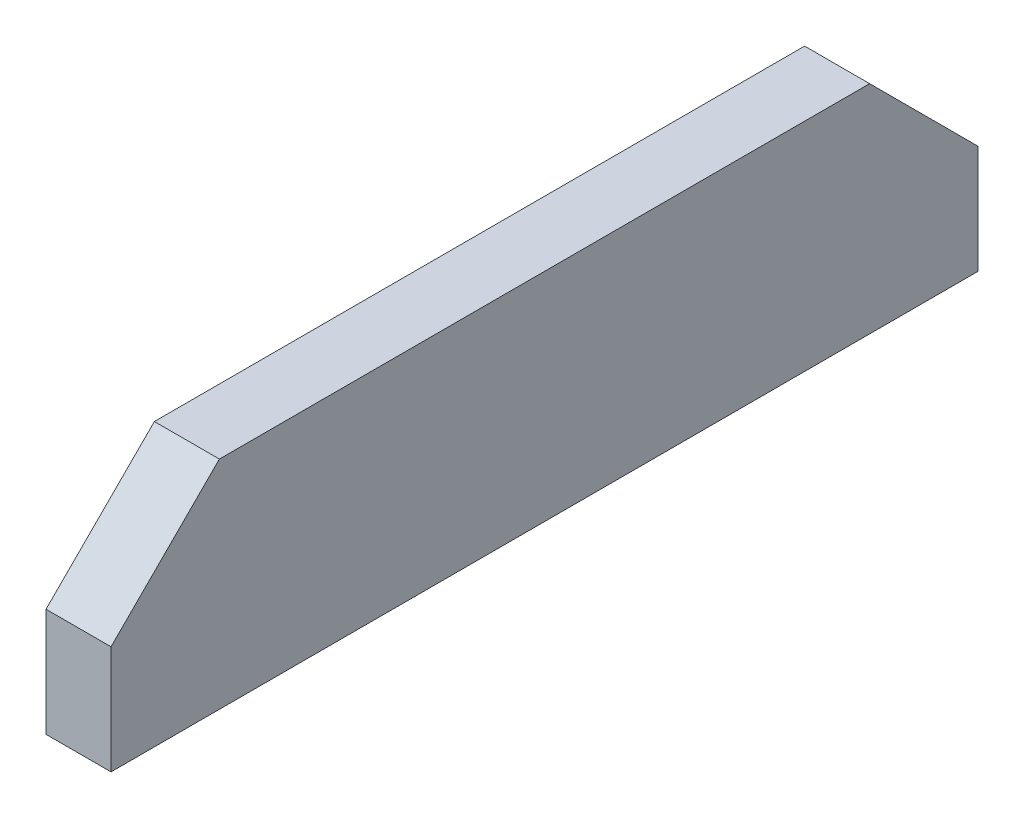
ISO-10303-21;
HEADER;
FILE_DESCRIPTION(('STEP AP214'),'2;1');
FILE_NAME('part.step','',(''),(''),'','','');
FILE_SCHEMA(('AUTOMOTIVE_DESIGN { 1 0 10303 214 1 1 1 1 }'));
ENDSEC;
DATA;
#1=APPLICATION_CONTEXT('core data for automotive mechanical design processes');
#2=APPLICATION_PROTOCOL_DEFINITION('international standard','automotive_design',2000,#1);
#3=PRODUCT_CONTEXT('',#1,'mechanical');
#4=PRODUCT('Part','Part','',(#3));
#5=PRODUCT_RELATED_PRODUCT_CATEGORY('part','',(#4));
#6=PRODUCT_DEFINITION_FORMATION('','',#4);
#7=PRODUCT_DEFINITION_CONTEXT('part definition',#1,'design');
#8=PRODUCT_DEFINITION('design','',#6,#7);
#9=PRODUCT_DEFINITION_SHAPE('','',#8);
#10=(LENGTH_UNIT() NAMED_UNIT(*) SI_UNIT(.MILLI.,.METRE.));
#11=(NAMED_UNIT(*) PLANE_ANGLE_UNIT() SI_UNIT($,.RADIAN.));
#12=(NAMED_UNIT(*) SI_UNIT($,.STERADIAN.) SOLID_ANGLE_UNIT());
#13=UNCERTAINTY_MEASURE_WITH_UNIT(LENGTH_MEASURE(1.E-05),#10,'distance_accuracy_value','');
#14=(GEOMETRIC_REPRESENTATION_CONTEXT(3) GLOBAL_UNCERTAINTY_ASSIGNED_CONTEXT((#13)) GLOBAL_UNIT_ASSIGNED_CONTEXT((#10,
#11,#12)) REPRESENTATION_CONTEXT('',''));
#15=CARTESIAN_POINT('',(0.,0.,0.));
#16=DIRECTION('',(0.,0.,1.));
#17=DIRECTION('',(1.,0.,0.));
#18=AXIS2_PLACEMENT_3D('',#15,#16,#17);
#19=CARTESIAN_POINT('',(3.,5.,0.));
#20=DIRECTION('',(0.,0.,-1.));
#21=DIRECTION('',(-1.,0.,0.));
#22=AXIS2_PLACEMENT_3D('',#19,#20,#21);
#23=PLANE('',#22);
#24=DIRECTION('',(0.,-1.,0.));
#25=VECTOR('',#24,1.);
#26=CARTESIAN_POINT('',(0.,5.,0.));
#27=LINE('',#26,#25);
#28=CARTESIAN_POINT('',(0.,5.,0.));
#29=VERTEX_POINT('',#28);
#30=CARTESIAN_POINT('',(0.,0.,0.));
#31=VERTEX_POINT('',#30);
#32=EDGE_CURVE('E118',#29,#31,#27,.T.);
#33=ORIENTED_EDGE('',*,*,#32,.T.);
#34=DIRECTION('',(-1.,0.,0.));
#35=VECTOR('',#34,1.);
#36=CARTESIAN_POINT('',(3.,0.,0.));
#37=LINE('',#36,#35);
#38=CARTESIAN_POINT('',(3.,0.,0.));
#39=VERTEX_POINT('',#38);
#40=EDGE_CURVE('E11',#39,#31,#37,.T.);
#41=ORIENTED_EDGE('',*,*,#40,.F.);
#42=DIRECTION('',(0.,-1.,0.));
#43=VECTOR('',#42,1.);
#44=CARTESIAN_POINT('',(3.,5.,0.));
#45=LINE('',#44,#43);
#46=CARTESIAN_POINT('',(3.,5.,0.));
#47=VERTEX_POINT('',#46);
#48=EDGE_CURVE('E128',#47,#39,#45,.T.);
#49=ORIENTED_EDGE('',*,*,#48,.F.);
#50=DIRECTION('',(-1.,0.,0.));
#51=VECTOR('',#50,1.);
#52=CARTESIAN_POINT('',(3.,5.,0.));
#53=LINE('',#52,#51);
#54=EDGE_CURVE('E114',#47,#29,#53,.T.);
#55=ORIENTED_EDGE('',*,*,#54,.T.);
#56=EDGE_LOOP('',(#33,#41,#49,#55));
#57=FACE_BOUND('',#56,.T.);
#58=ADVANCED_FACE('F34',(#57),#23,.F.);
#59=CARTESIAN_POINT('',(3.,0.,0.));
#60=DIRECTION('',(0.,1.,0.));
#61=DIRECTION('',(0.,0.,1.));
#62=AXIS2_PLACEMENT_3D('',#59,#60,#61);
#63=PLANE('',#62);
#64=DIRECTION('',(0.,0.,-1.));
#65=VECTOR('',#64,1.);
#66=CARTESIAN_POINT('',(0.,0.,0.));
#67=LINE('',#66,#65);
#68=CARTESIAN_POINT('',(0.,0.,-40.));
#69=VERTEX_POINT('',#68);
#70=EDGE_CURVE('E121',#31,#69,#67,.T.);
#71=ORIENTED_EDGE('',*,*,#70,.T.);
#72=DIRECTION('',(-1.,0.,0.));
#73=VECTOR('',#72,1.);
#74=CARTESIAN_POINT('',(3.,0.,-40.));
#75=LINE('',#74,#73);
#76=CARTESIAN_POINT('',(3.,0.,-40.));
#77=VERTEX_POINT('',#76);
#78=EDGE_CURVE('E42',#77,#69,#75,.T.);
#79=ORIENTED_EDGE('',*,*,#78,.F.);
#80=DIRECTION('',(0.,0.,-1.));
#81=VECTOR('',#80,1.);
#82=CARTESIAN_POINT('',(3.,0.,0.));
#83=LINE('',#82,#81);
#84=EDGE_CURVE('E87',#39,#77,#83,.T.);
#85=ORIENTED_EDGE('',*,*,#84,.F.);
#86=ORIENTED_EDGE('',*,*,#40,.T.);
#87=EDGE_LOOP('',(#71,#79,#85,#86));
#88=FACE_BOUND('',#87,.T.);
#89=ADVANCED_FACE('F152',(#88),#63,.F.);
#90=CARTESIAN_POINT('',(3.,0.,-40.));
#91=DIRECTION('',(0.,0.,1.));
#92=DIRECTION('',(1.,0.,0.));
#93=AXIS2_PLACEMENT_3D('',#90,#91,#92);
#94=PLANE('',#93);
#95=DIRECTION('',(0.,1.,0.));
#96=VECTOR('',#95,1.);
#97=CARTESIAN_POINT('',(0.,0.,-40.));
#98=LINE('',#97,#96);
#99=CARTESIAN_POINT('',(0.,5.,-40.));
#100=VERTEX_POINT('',#99);
#101=EDGE_CURVE('E123',#69,#100,#98,.T.);
#102=ORIENTED_EDGE('',*,*,#101,.T.);
#103=DIRECTION('',(-1.,0.,0.));
#104=VECTOR('',#103,1.);
#105=CARTESIAN_POINT('',(3.,5.,-40.));
#106=LINE('',#105,#104);
#107=CARTESIAN_POINT('',(3.,5.,-40.));
#108=VERTEX_POINT('',#107);
#109=EDGE_CURVE('E109',#108,#100,#106,.T.);
#110=ORIENTED_EDGE('',*,*,#109,.F.);
#111=DIRECTION('',(0.,1.,0.));
#112=VECTOR('',#111,1.);
#113=CARTESIAN_POINT('',(3.,0.,-40.));
#114=LINE('',#113,#112);
#115=EDGE_CURVE('E100',#77,#108,#114,.T.);
#116=ORIENTED_EDGE('',*,*,#115,.F.);
#117=ORIENTED_EDGE('',*,*,#78,.T.);
#118=EDGE_LOOP('',(#102,#110,#116,#117));
#119=FACE_BOUND('',#118,.T.);
#120=ADVANCED_FACE('F134',(#119),#94,.F.);
#121=CARTESIAN_POINT('',(3.,5.,-40.));
#122=DIRECTION('',(0.,-0.707106781186547,0.707106781186548));
#123=DIRECTION('',(0.,-0.707106781186548,-0.707106781186547));
#124=AXIS2_PLACEMENT_3D('',#121,#122,#123);
#125=PLANE('',#124);
#126=DIRECTION('',(0.,0.707106781186548,0.707106781186547));
#127=VECTOR('',#126,1.);
#128=CARTESIAN_POINT('',(0.,5.,-40.));
#129=LINE('',#128,#127);
#130=CARTESIAN_POINT('',(0.,10.,-35.));
#131=VERTEX_POINT('',#130);
#132=EDGE_CURVE('E108',#100,#131,#129,.T.);
#133=ORIENTED_EDGE('',*,*,#132,.T.);
#134=DIRECTION('',(-1.,0.,0.));
#135=VECTOR('',#134,1.);
#136=CARTESIAN_POINT('',(3.,10.,-35.));
#137=LINE('',#136,#135);
#138=CARTESIAN_POINT('',(3.,10.,-35.));
#139=VERTEX_POINT('',#138);
#140=EDGE_CURVE('E105',#139,#131,#137,.T.);
#141=ORIENTED_EDGE('',*,*,#140,.F.);
#142=DIRECTION('',(0.,0.707106781186548,0.707106781186547));
#143=VECTOR('',#142,1.);
#144=CARTESIAN_POINT('',(3.,5.,-40.));
#145=LINE('',#144,#143);
#146=EDGE_CURVE('E94',#108,#139,#145,.T.);
#147=ORIENTED_EDGE('',*,*,#146,.F.);
#148=ORIENTED_EDGE('',*,*,#109,.T.);
#149=EDGE_LOOP('',(#133,#141,#147,#148));
#150=FACE_BOUND('',#149,.T.);
#151=ADVANCED_FACE('F106',(#150),#125,.F.);
#152=CARTESIAN_POINT('',(3.,10.,-35.));
#153=DIRECTION('',(0.,-1.,0.));
#154=DIRECTION('',(0.,0.,-1.));
#155=AXIS2_PLACEMENT_3D('',#152,#153,#154);
#156=PLANE('',#155);
#157=DIRECTION('',(0.,0.,1.));
#158=VECTOR('',#157,1.);
#159=CARTESIAN_POINT('',(0.,10.,-35.));
#160=LINE('',#159,#158);
#161=CARTESIAN_POINT('',(0.,10.,-5.));
#162=VERTEX_POINT('',#161);
#163=EDGE_CURVE('E73',#131,#162,#160,.T.);
#164=ORIENTED_EDGE('',*,*,#163,.T.);
#165=DIRECTION('',(-1.,0.,0.));
#166=VECTOR('',#165,1.);
#167=CARTESIAN_POINT('',(3.,10.,-5.));
#168=LINE('',#167,#166);
#169=CARTESIAN_POINT('',(3.,10.,-5.));
#170=VERTEX_POINT('',#169);
#171=EDGE_CURVE('E110',#170,#162,#168,.T.);
#172=ORIENTED_EDGE('',*,*,#171,.F.);
#173=DIRECTION('',(0.,0.,1.));
#174=VECTOR('',#173,1.);
#175=CARTESIAN_POINT('',(3.,10.,-35.));
#176=LINE('',#175,#174);
#177=EDGE_CURVE('E98',#139,#170,#176,.T.);
#178=ORIENTED_EDGE('',*,*,#177,.F.);
#179=ORIENTED_EDGE('',*,*,#140,.T.);
#180=EDGE_LOOP('',(#164,#172,#178,#179));
#181=FACE_BOUND('',#180,.T.);
#182=ADVANCED_FACE('F112',(#181),#156,.F.);
#183=CARTESIAN_POINT('',(3.,10.,-5.));
#184=DIRECTION('',(0.,-0.707106781186547,-0.707106781186548));
#185=DIRECTION('',(0.,0.707106781186548,-0.707106781186547));
#186=AXIS2_PLACEMENT_3D('',#183,#184,#185);
#187=PLANE('',#186);
#188=DIRECTION('',(0.,-0.707106781186548,0.707106781186547));
#189=VECTOR('',#188,1.);
#190=CARTESIAN_POINT('',(0.,10.,-5.));
#191=LINE('',#190,#189);
#192=EDGE_CURVE('E79',#162,#29,#191,.T.);
#193=ORIENTED_EDGE('',*,*,#192,.T.);
#194=ORIENTED_EDGE('',*,*,#54,.F.);
#195=DIRECTION('',(0.,-0.707106781186548,0.707106781186547));
#196=VECTOR('',#195,1.);
#197=CARTESIAN_POINT('',(3.,10.,-5.));
#198=LINE('',#197,#196);
#199=EDGE_CURVE('E50',#170,#47,#198,.T.);
#200=ORIENTED_EDGE('',*,*,#199,.F.);
#201=ORIENTED_EDGE('',*,*,#171,.T.);
#202=EDGE_LOOP('',(#193,#194,#200,#201));
#203=FACE_BOUND('',#202,.T.);
#204=ADVANCED_FACE('F141',(#203),#187,.F.);
#205=CARTESIAN_POINT('',(3.,0.,0.));
#206=DIRECTION('',(1.,0.,0.));
#207=DIRECTION('',(0.,0.,-1.));
#208=AXIS2_PLACEMENT_3D('',#205,#206,#207);
#209=PLANE('',#208);
#210=ORIENTED_EDGE('',*,*,#48,.T.);
#211=ORIENTED_EDGE('',*,*,#84,.T.);
#212=ORIENTED_EDGE('',*,*,#115,.T.);
#213=ORIENTED_EDGE('',*,*,#146,.T.);
#214=ORIENTED_EDGE('',*,*,#177,.T.);
#215=ORIENTED_EDGE('',*,*,#199,.T.);
#216=EDGE_LOOP('',(#210,#211,#212,#213,#214,#215));
#217=FACE_BOUND('',#216,.T.);
#218=ADVANCED_FACE('F96',(#217),#209,.T.);
#219=CARTESIAN_POINT('',(0.,0.,0.));
#220=DIRECTION('',(1.,0.,0.));
#221=DIRECTION('',(0.,0.,-1.));
#222=AXIS2_PLACEMENT_3D('',#219,#220,#221);
#223=PLANE('',#222);
#224=ORIENTED_EDGE('',*,*,#32,.F.);
#225=ORIENTED_EDGE('',*,*,#192,.F.);
#226=ORIENTED_EDGE('',*,*,#163,.F.);
#227=ORIENTED_EDGE('',*,*,#132,.F.);
#228=ORIENTED_EDGE('',*,*,#101,.F.);
#229=ORIENTED_EDGE('',*,*,#70,.F.);
#230=EDGE_LOOP('',(#224,#225,#226,#227,#228,#229));
#231=FACE_BOUND('',#230,.T.);
#232=ADVANCED_FACE('F137',(#231),#223,.F.);
#233=CLOSED_SHELL('',(#58,#89,#120,#151,#182,#204,#218,#232));
#234=MANIFOLD_SOLID_BREP('B2',#233);
#235=ADVANCED_BREP_SHAPE_REPRESENTATION('',(#18,#234),#14);
#236=SHAPE_DEFINITION_REPRESENTATION(#9,#235);
ENDSEC;
END-ISO-10303-21;
